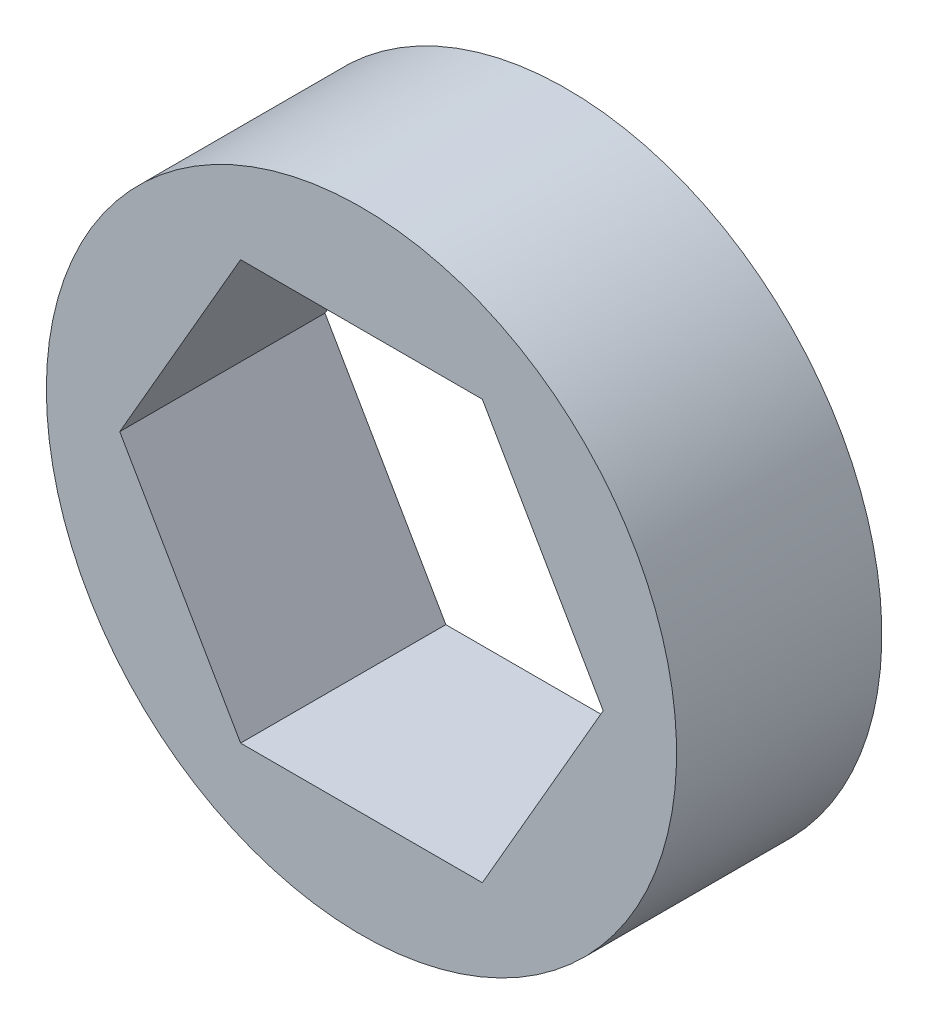
ISO-10303-21;
HEADER;
FILE_DESCRIPTION(('STEP AP214'),'2;1');
FILE_NAME('part.step','',(''),(''),'','','');
FILE_SCHEMA(('AUTOMOTIVE_DESIGN { 1 0 10303 214 1 1 1 1 }'));
ENDSEC;
DATA;
#1=APPLICATION_CONTEXT('core data for automotive mechanical design processes');
#2=APPLICATION_PROTOCOL_DEFINITION('international standard','automotive_design',2000,#1);
#3=PRODUCT_CONTEXT('',#1,'mechanical');
#4=PRODUCT('Part','Part','',(#3));
#5=PRODUCT_RELATED_PRODUCT_CATEGORY('part','',(#4));
#6=PRODUCT_DEFINITION_FORMATION('','',#4);
#7=PRODUCT_DEFINITION_CONTEXT('part definition',#1,'design');
#8=PRODUCT_DEFINITION('design','',#6,#7);
#9=PRODUCT_DEFINITION_SHAPE('','',#8);
#10=(LENGTH_UNIT() NAMED_UNIT(*) SI_UNIT(.MILLI.,.METRE.));
#11=(NAMED_UNIT(*) PLANE_ANGLE_UNIT() SI_UNIT($,.RADIAN.));
#12=(NAMED_UNIT(*) SI_UNIT($,.STERADIAN.) SOLID_ANGLE_UNIT());
#13=UNCERTAINTY_MEASURE_WITH_UNIT(LENGTH_MEASURE(1.E-05),#10,'distance_accuracy_value','');
#14=(GEOMETRIC_REPRESENTATION_CONTEXT(3) GLOBAL_UNCERTAINTY_ASSIGNED_CONTEXT((#13)) GLOBAL_UNIT_ASSIGNED_CONTEXT((#10,
#11,#12)) REPRESENTATION_CONTEXT('',''));
#15=CARTESIAN_POINT('',(0.,0.,0.));
#16=DIRECTION('',(0.,0.,1.));
#17=DIRECTION('',(1.,0.,0.));
#18=AXIS2_PLACEMENT_3D('',#15,#16,#17);
#19=CARTESIAN_POINT('',(-7.47899538708241,0.,3.175));
#20=DIRECTION('',(0.866025403784439,0.5,0.));
#21=DIRECTION('',(-0.5,0.866025403784439,0.));
#22=AXIS2_PLACEMENT_3D('',#19,#20,#21);
#23=PLANE('',#22);
#24=DIRECTION('',(-0.5,0.866025403784438,0.));
#25=VECTOR('',#24,1.);
#26=CARTESIAN_POINT('',(-3.73949769354121,-6.477,3.175));
#27=LINE('',#26,#25);
#28=CARTESIAN_POINT('',(-3.73949769354121,-6.477,3.175));
#29=VERTEX_POINT('',#28);
#30=CARTESIAN_POINT('',(-7.47899538708241,0.,3.175));
#31=VERTEX_POINT('',#30);
#32=EDGE_CURVE('E92',#29,#31,#27,.T.);
#33=ORIENTED_EDGE('',*,*,#32,.F.);
#34=DIRECTION('',(0.,0.,1.));
#35=VECTOR('',#34,1.);
#36=CARTESIAN_POINT('',(-3.73949769354121,-6.477,3.175));
#37=LINE('',#36,#35);
#38=CARTESIAN_POINT('',(-3.73949769354121,-6.477,-3.175));
#39=VERTEX_POINT('',#38);
#40=EDGE_CURVE('E84',#39,#29,#37,.T.);
#41=ORIENTED_EDGE('',*,*,#40,.F.);
#42=DIRECTION('',(-0.5,0.866025403784439,0.));
#43=VECTOR('',#42,1.);
#44=CARTESIAN_POINT('',(-3.73949769354121,-6.477,-3.175));
#45=LINE('',#44,#43);
#46=CARTESIAN_POINT('',(-7.47899538708241,0.,-3.175));
#47=VERTEX_POINT('',#46);
#48=EDGE_CURVE('E124',#39,#47,#45,.T.);
#49=ORIENTED_EDGE('',*,*,#48,.T.);
#50=DIRECTION('',(0.,0.,1.));
#51=VECTOR('',#50,1.);
#52=CARTESIAN_POINT('',(-7.47899538708241,0.,3.175));
#53=LINE('',#52,#51);
#54=EDGE_CURVE('E109',#31,#47,#53,.F.);
#55=ORIENTED_EDGE('',*,*,#54,.F.);
#56=EDGE_LOOP('',(#33,#41,#49,#55));
#57=FACE_BOUND('',#56,.T.);
#58=ADVANCED_FACE('F25',(#57),#23,.T.);
#59=CARTESIAN_POINT('',(-3.73949769354121,6.477,3.175));
#60=DIRECTION('',(0.866025403784439,-0.5,0.));
#61=DIRECTION('',(0.5,0.866025403784439,0.));
#62=AXIS2_PLACEMENT_3D('',#59,#60,#61);
#63=PLANE('',#62);
#64=DIRECTION('',(0.5,0.866025403784439,0.));
#65=VECTOR('',#64,1.);
#66=CARTESIAN_POINT('',(-7.47899538708242,0.,3.175));
#67=LINE('',#66,#65);
#68=CARTESIAN_POINT('',(-3.73949769354121,6.477,3.175));
#69=VERTEX_POINT('',#68);
#70=EDGE_CURVE('E117',#31,#69,#67,.T.);
#71=ORIENTED_EDGE('',*,*,#70,.F.);
#72=ORIENTED_EDGE('',*,*,#54,.T.);
#73=DIRECTION('',(0.5,0.866025403784439,0.));
#74=VECTOR('',#73,1.);
#75=CARTESIAN_POINT('',(-7.47899538708241,0.,-3.175));
#76=LINE('',#75,#74);
#77=CARTESIAN_POINT('',(-3.73949769354121,6.477,-3.175));
#78=VERTEX_POINT('',#77);
#79=EDGE_CURVE('E115',#47,#78,#76,.T.);
#80=ORIENTED_EDGE('',*,*,#79,.T.);
#81=DIRECTION('',(0.,0.,1.));
#82=VECTOR('',#81,1.);
#83=CARTESIAN_POINT('',(-3.73949769354121,6.477,3.175));
#84=LINE('',#83,#82);
#85=EDGE_CURVE('E106',#69,#78,#84,.F.);
#86=ORIENTED_EDGE('',*,*,#85,.F.);
#87=EDGE_LOOP('',(#71,#72,#80,#86));
#88=FACE_BOUND('',#87,.T.);
#89=ADVANCED_FACE('F114',(#88),#63,.T.);
#90=CARTESIAN_POINT('',(3.7394976935412,6.477,3.175));
#91=DIRECTION('',(0.,-1.,0.));
#92=DIRECTION('',(1.,0.,0.));
#93=AXIS2_PLACEMENT_3D('',#90,#91,#92);
#94=PLANE('',#93);
#95=DIRECTION('',(1.,0.,0.));
#96=VECTOR('',#95,1.);
#97=CARTESIAN_POINT('',(0.,6.477,3.175));
#98=LINE('',#97,#96);
#99=CARTESIAN_POINT('',(3.7394976935412,6.477,3.175));
#100=VERTEX_POINT('',#99);
#101=EDGE_CURVE('E134',#69,#100,#98,.T.);
#102=ORIENTED_EDGE('',*,*,#101,.F.);
#103=ORIENTED_EDGE('',*,*,#85,.T.);
#104=DIRECTION('',(1.,0.,0.));
#105=VECTOR('',#104,1.);
#106=CARTESIAN_POINT('',(0.,6.477,-3.175));
#107=LINE('',#106,#105);
#108=CARTESIAN_POINT('',(3.7394976935412,6.477,-3.175));
#109=VERTEX_POINT('',#108);
#110=EDGE_CURVE('E126',#78,#109,#107,.T.);
#111=ORIENTED_EDGE('',*,*,#110,.T.);
#112=DIRECTION('',(0.,0.,1.));
#113=VECTOR('',#112,1.);
#114=CARTESIAN_POINT('',(3.7394976935412,6.47700000000001,3.175));
#115=LINE('',#114,#113);
#116=EDGE_CURVE('E103',#100,#109,#115,.F.);
#117=ORIENTED_EDGE('',*,*,#116,.F.);
#118=EDGE_LOOP('',(#102,#103,#111,#117));
#119=FACE_BOUND('',#118,.T.);
#120=ADVANCED_FACE('F143',(#119),#94,.T.);
#121=CARTESIAN_POINT('',(7.47899538708241,0.,3.175));
#122=DIRECTION('',(-0.866025403784439,-0.5,0.));
#123=DIRECTION('',(0.5,-0.866025403784439,0.));
#124=AXIS2_PLACEMENT_3D('',#121,#122,#123);
#125=PLANE('',#124);
#126=DIRECTION('',(0.5,-0.866025403784438,0.));
#127=VECTOR('',#126,1.);
#128=CARTESIAN_POINT('',(3.7394976935412,6.477,3.175));
#129=LINE('',#128,#127);
#130=CARTESIAN_POINT('',(7.47899538708242,0.,3.175));
#131=VERTEX_POINT('',#130);
#132=EDGE_CURVE('E97',#100,#131,#129,.T.);
#133=ORIENTED_EDGE('',*,*,#132,.F.);
#134=ORIENTED_EDGE('',*,*,#116,.T.);
#135=DIRECTION('',(0.5,-0.866025403784438,0.));
#136=VECTOR('',#135,1.);
#137=CARTESIAN_POINT('',(3.7394976935412,6.477,-3.175));
#138=LINE('',#137,#136);
#139=CARTESIAN_POINT('',(7.47899538708241,0.,-3.175));
#140=VERTEX_POINT('',#139);
#141=EDGE_CURVE('E128',#109,#140,#138,.T.);
#142=ORIENTED_EDGE('',*,*,#141,.T.);
#143=DIRECTION('',(0.,0.,1.));
#144=VECTOR('',#143,1.);
#145=CARTESIAN_POINT('',(7.47899538708242,0.,3.175));
#146=LINE('',#145,#144);
#147=EDGE_CURVE('E73',#131,#140,#146,.F.);
#148=ORIENTED_EDGE('',*,*,#147,.F.);
#149=EDGE_LOOP('',(#133,#134,#142,#148));
#150=FACE_BOUND('',#149,.T.);
#151=ADVANCED_FACE('F140',(#150),#125,.T.);
#152=CARTESIAN_POINT('',(3.73949769354121,-6.477,3.175));
#153=DIRECTION('',(-0.866025403784439,0.5,0.));
#154=DIRECTION('',(-0.5,-0.866025403784439,0.));
#155=AXIS2_PLACEMENT_3D('',#152,#153,#154);
#156=PLANE('',#155);
#157=DIRECTION('',(-0.5,-0.866025403784439,0.));
#158=VECTOR('',#157,1.);
#159=CARTESIAN_POINT('',(7.47899538708241,0.,3.175));
#160=LINE('',#159,#158);
#161=CARTESIAN_POINT('',(3.73949769354121,-6.477,3.175));
#162=VERTEX_POINT('',#161);
#163=EDGE_CURVE('E79',#131,#162,#160,.T.);
#164=ORIENTED_EDGE('',*,*,#163,.F.);
#165=ORIENTED_EDGE('',*,*,#147,.T.);
#166=DIRECTION('',(-0.5,-0.866025403784439,0.));
#167=VECTOR('',#166,1.);
#168=CARTESIAN_POINT('',(7.47899538708241,0.,-3.175));
#169=LINE('',#168,#167);
#170=CARTESIAN_POINT('',(3.73949769354121,-6.477,-3.175));
#171=VERTEX_POINT('',#170);
#172=EDGE_CURVE('E41',#140,#171,#169,.T.);
#173=ORIENTED_EDGE('',*,*,#172,.T.);
#174=DIRECTION('',(0.,0.,1.));
#175=VECTOR('',#174,1.);
#176=CARTESIAN_POINT('',(3.73949769354121,-6.477,3.175));
#177=LINE('',#176,#175);
#178=EDGE_CURVE('E75',#162,#171,#177,.F.);
#179=ORIENTED_EDGE('',*,*,#178,.F.);
#180=EDGE_LOOP('',(#164,#165,#173,#179));
#181=FACE_BOUND('',#180,.T.);
#182=ADVANCED_FACE('F77',(#181),#156,.T.);
#183=CARTESIAN_POINT('',(-3.73949769354121,-6.477,3.175));
#184=DIRECTION('',(0.,1.,0.));
#185=DIRECTION('',(0.,0.,1.));
#186=AXIS2_PLACEMENT_3D('',#183,#184,#185);
#187=PLANE('',#186);
#188=DIRECTION('',(1.,0.,0.));
#189=VECTOR('',#188,1.);
#190=CARTESIAN_POINT('',(0.,-6.477,3.175));
#191=LINE('',#190,#189);
#192=EDGE_CURVE('E87',#162,#29,#191,.F.);
#193=ORIENTED_EDGE('',*,*,#192,.F.);
#194=ORIENTED_EDGE('',*,*,#178,.T.);
#195=DIRECTION('',(1.,0.,0.));
#196=VECTOR('',#195,1.);
#197=CARTESIAN_POINT('',(0.,-6.477,-3.175));
#198=LINE('',#197,#196);
#199=EDGE_CURVE('E136',#171,#39,#198,.F.);
#200=ORIENTED_EDGE('',*,*,#199,.T.);
#201=ORIENTED_EDGE('',*,*,#40,.T.);
#202=EDGE_LOOP('',(#193,#194,#200,#201));
#203=FACE_BOUND('',#202,.T.);
#204=ADVANCED_FACE('F88',(#203),#187,.T.);
#205=CARTESIAN_POINT('',(0.,0.,3.175));
#206=DIRECTION('',(0.,0.,1.));
#207=DIRECTION('',(1.,0.,0.));
#208=AXIS2_PLACEMENT_3D('',#205,#206,#207);
#209=PLANE('',#208);
#210=ORIENTED_EDGE('',*,*,#101,.T.);
#211=ORIENTED_EDGE('',*,*,#132,.T.);
#212=ORIENTED_EDGE('',*,*,#163,.T.);
#213=ORIENTED_EDGE('',*,*,#192,.T.);
#214=ORIENTED_EDGE('',*,*,#32,.T.);
#215=ORIENTED_EDGE('',*,*,#70,.T.);
#216=EDGE_LOOP('',(#210,#211,#212,#213,#214,#215));
#217=FACE_BOUND('',#216,.T.);
#218=CARTESIAN_POINT('',(0.,0.,3.175));
#219=DIRECTION('',(0.,0.,-1.));
#220=DIRECTION('',(-1.,0.,0.));
#221=AXIS2_PLACEMENT_3D('',#218,#219,#220);
#222=CIRCLE('',#221,9.75);
#223=CARTESIAN_POINT('',(-9.75,0.,3.175));
#224=VERTEX_POINT('',#223);
#225=EDGE_CURVE('E28',#224,#224,#222,.T.);
#226=ORIENTED_EDGE('',*,*,#225,.F.);
#227=EDGE_LOOP('',(#226));
#228=FACE_BOUND('',#227,.T.);
#229=ADVANCED_FACE('F95',(#217,#228),#209,.T.);
#230=CARTESIAN_POINT('',(0.,0.,-3.175));
#231=DIRECTION('',(0.,0.,1.));
#232=DIRECTION('',(1.,0.,0.));
#233=AXIS2_PLACEMENT_3D('',#230,#231,#232);
#234=PLANE('',#233);
#235=ORIENTED_EDGE('',*,*,#172,.F.);
#236=ORIENTED_EDGE('',*,*,#141,.F.);
#237=ORIENTED_EDGE('',*,*,#110,.F.);
#238=ORIENTED_EDGE('',*,*,#79,.F.);
#239=ORIENTED_EDGE('',*,*,#48,.F.);
#240=ORIENTED_EDGE('',*,*,#199,.F.);
#241=EDGE_LOOP('',(#235,#236,#237,#238,#239,#240));
#242=FACE_BOUND('',#241,.T.);
#243=CARTESIAN_POINT('',(0.,0.,-3.175));
#244=DIRECTION('',(0.,0.,-1.));
#245=DIRECTION('',(-1.,0.,0.));
#246=AXIS2_PLACEMENT_3D('',#243,#244,#245);
#247=CIRCLE('',#246,9.75);
#248=CARTESIAN_POINT('',(-9.75,0.,-3.175));
#249=VERTEX_POINT('',#248);
#250=EDGE_CURVE('E13',#249,#249,#247,.F.);
#251=ORIENTED_EDGE('',*,*,#250,.F.);
#252=EDGE_LOOP('',(#251));
#253=FACE_BOUND('',#252,.T.);
#254=ADVANCED_FACE('F122',(#242,#253),#234,.F.);
#255=CARTESIAN_POINT('',(0.,0.,3.175));
#256=DIRECTION('',(0.,0.,-1.));
#257=DIRECTION('',(-1.,0.,0.));
#258=AXIS2_PLACEMENT_3D('',#255,#256,#257);
#259=CYLINDRICAL_SURFACE('',#258,9.75);
#260=ORIENTED_EDGE('',*,*,#250,.T.);
#261=EDGE_LOOP('',(#260));
#262=FACE_BOUND('',#261,.T.);
#263=ORIENTED_EDGE('',*,*,#225,.T.);
#264=EDGE_LOOP('',(#263));
#265=FACE_BOUND('',#264,.T.);
#266=ADVANCED_FACE('F152',(#262,#265),#259,.T.);
#267=CLOSED_SHELL('',(#58,#89,#120,#151,#182,#204,#229,#254,#266));
#268=MANIFOLD_SOLID_BREP('B1',#267);
#269=ADVANCED_BREP_SHAPE_REPRESENTATION('',(#18,#268),#14);
#270=SHAPE_DEFINITION_REPRESENTATION(#9,#269);
ENDSEC;
END-ISO-10303-21;
